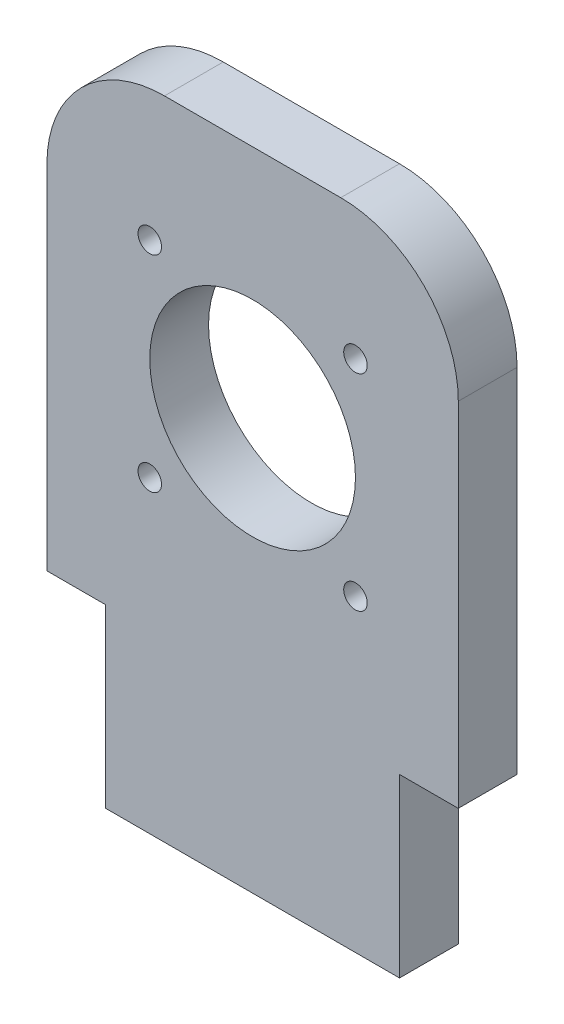
ISO-10303-21;
HEADER;
FILE_DESCRIPTION(('STEP AP214'),'2;1');
FILE_NAME('part.step','',(''),(''),'','','');
FILE_SCHEMA(('AUTOMOTIVE_DESIGN { 1 0 10303 214 1 1 1 1 }'));
ENDSEC;
DATA;
#1=APPLICATION_CONTEXT('core data for automotive mechanical design processes');
#2=APPLICATION_PROTOCOL_DEFINITION('international standard','automotive_design',2000,#1);
#3=PRODUCT_CONTEXT('',#1,'mechanical');
#4=PRODUCT('Part','Part','',(#3));
#5=PRODUCT_RELATED_PRODUCT_CATEGORY('part','',(#4));
#6=PRODUCT_DEFINITION_FORMATION('','',#4);
#7=PRODUCT_DEFINITION_CONTEXT('part definition',#1,'design');
#8=PRODUCT_DEFINITION('design','',#6,#7);
#9=PRODUCT_DEFINITION_SHAPE('','',#8);
#10=(LENGTH_UNIT() NAMED_UNIT(*) SI_UNIT(.MILLI.,.METRE.));
#11=(NAMED_UNIT(*) PLANE_ANGLE_UNIT() SI_UNIT($,.RADIAN.));
#12=(NAMED_UNIT(*) SI_UNIT($,.STERADIAN.) SOLID_ANGLE_UNIT());
#13=UNCERTAINTY_MEASURE_WITH_UNIT(LENGTH_MEASURE(1.E-05),#10,'distance_accuracy_value','');
#14=(GEOMETRIC_REPRESENTATION_CONTEXT(3) GLOBAL_UNCERTAINTY_ASSIGNED_CONTEXT((#13)) GLOBAL_UNIT_ASSIGNED_CONTEXT((#10,
#11,#12)) REPRESENTATION_CONTEXT('',''));
#15=CARTESIAN_POINT('',(0.,0.,0.));
#16=DIRECTION('',(0.,0.,1.));
#17=DIRECTION('',(1.,0.,0.));
#18=AXIS2_PLACEMENT_3D('',#15,#16,#17);
#19=CARTESIAN_POINT('',(10.,0.,10.));
#20=DIRECTION('',(1.,0.,0.));
#21=DIRECTION('',(0.,1.,0.));
#22=AXIS2_PLACEMENT_3D('',#19,#20,#21);
#23=PLANE('',#22);
#24=DIRECTION('',(0.,-1.,0.));
#25=VECTOR('',#24,1.);
#26=CARTESIAN_POINT('',(10.,0.,0.));
#27=LINE('',#26,#25);
#28=CARTESIAN_POINT('',(10.,-80.,0.));
#29=VERTEX_POINT('',#28);
#30=CARTESIAN_POINT('',(10.,-110.,0.));
#31=VERTEX_POINT('',#30);
#32=EDGE_CURVE('E176',#29,#31,#27,.T.);
#33=ORIENTED_EDGE('',*,*,#32,.T.);
#34=DIRECTION('',(0.,0.,-1.));
#35=VECTOR('',#34,1.);
#36=CARTESIAN_POINT('',(10.,-110.,10.));
#37=LINE('',#36,#35);
#38=CARTESIAN_POINT('',(10.,-110.,10.));
#39=VERTEX_POINT('',#38);
#40=EDGE_CURVE('E158',#39,#31,#37,.T.);
#41=ORIENTED_EDGE('',*,*,#40,.F.);
#42=DIRECTION('',(0.,-1.,0.));
#43=VECTOR('',#42,1.);
#44=CARTESIAN_POINT('',(10.,0.,10.));
#45=LINE('',#44,#43);
#46=CARTESIAN_POINT('',(10.,-80.,10.));
#47=VERTEX_POINT('',#46);
#48=EDGE_CURVE('E164',#47,#39,#45,.T.);
#49=ORIENTED_EDGE('',*,*,#48,.F.);
#50=DIRECTION('',(0.,0.,-1.));
#51=VECTOR('',#50,1.);
#52=CARTESIAN_POINT('',(10.,-80.,10.));
#53=LINE('',#52,#51);
#54=EDGE_CURVE('E253',#47,#29,#53,.T.);
#55=ORIENTED_EDGE('',*,*,#54,.T.);
#56=EDGE_LOOP('',(#33,#41,#49,#55));
#57=FACE_BOUND('',#56,.T.);
#58=ADVANCED_FACE('F74',(#57),#23,.F.);
#59=CARTESIAN_POINT('',(0.,-110.,10.));
#60=DIRECTION('',(0.,1.,0.));
#61=DIRECTION('',(-1.,0.,0.));
#62=AXIS2_PLACEMENT_3D('',#59,#60,#61);
#63=PLANE('',#62);
#64=DIRECTION('',(1.,0.,0.));
#65=VECTOR('',#64,1.);
#66=CARTESIAN_POINT('',(0.,-110.,0.));
#67=LINE('',#66,#65);
#68=CARTESIAN_POINT('',(60.,-110.,0.));
#69=VERTEX_POINT('',#68);
#70=EDGE_CURVE('E248',#31,#69,#67,.T.);
#71=ORIENTED_EDGE('',*,*,#70,.T.);
#72=DIRECTION('',(0.,0.,-1.));
#73=VECTOR('',#72,1.);
#74=CARTESIAN_POINT('',(60.,-110.,10.));
#75=LINE('',#74,#73);
#76=CARTESIAN_POINT('',(60.,-110.,10.));
#77=VERTEX_POINT('',#76);
#78=EDGE_CURVE('E160',#77,#69,#75,.T.);
#79=ORIENTED_EDGE('',*,*,#78,.F.);
#80=DIRECTION('',(1.,0.,0.));
#81=VECTOR('',#80,1.);
#82=CARTESIAN_POINT('',(0.,-110.,10.));
#83=LINE('',#82,#81);
#84=EDGE_CURVE('E153',#39,#77,#83,.T.);
#85=ORIENTED_EDGE('',*,*,#84,.F.);
#86=ORIENTED_EDGE('',*,*,#40,.T.);
#87=EDGE_LOOP('',(#71,#79,#85,#86));
#88=FACE_BOUND('',#87,.T.);
#89=ADVANCED_FACE('F156',(#88),#63,.F.);
#90=CARTESIAN_POINT('',(60.,0.,10.));
#91=DIRECTION('',(1.,0.,0.));
#92=DIRECTION('',(0.,1.,0.));
#93=AXIS2_PLACEMENT_3D('',#90,#91,#92);
#94=PLANE('',#93);
#95=DIRECTION('',(0.,-1.,0.));
#96=VECTOR('',#95,1.);
#97=CARTESIAN_POINT('',(60.,0.,0.));
#98=LINE('',#97,#96);
#99=CARTESIAN_POINT('',(60.,-80.,0.));
#100=VERTEX_POINT('',#99);
#101=EDGE_CURVE('E173',#100,#69,#98,.T.);
#102=ORIENTED_EDGE('',*,*,#101,.F.);
#103=DIRECTION('',(0.,0.,-1.));
#104=VECTOR('',#103,1.);
#105=CARTESIAN_POINT('',(60.,-80.,10.));
#106=LINE('',#105,#104);
#107=CARTESIAN_POINT('',(60.,-80.,10.));
#108=VERTEX_POINT('',#107);
#109=EDGE_CURVE('E181',#108,#100,#106,.T.);
#110=ORIENTED_EDGE('',*,*,#109,.F.);
#111=DIRECTION('',(0.,-1.,0.));
#112=VECTOR('',#111,1.);
#113=CARTESIAN_POINT('',(60.,0.,10.));
#114=LINE('',#113,#112);
#115=EDGE_CURVE('E163',#108,#77,#114,.T.);
#116=ORIENTED_EDGE('',*,*,#115,.T.);
#117=ORIENTED_EDGE('',*,*,#78,.T.);
#118=EDGE_LOOP('',(#102,#110,#116,#117));
#119=FACE_BOUND('',#118,.T.);
#120=ADVANCED_FACE('F247',(#119),#94,.T.);
#121=CARTESIAN_POINT('',(0.,0.,10.));
#122=DIRECTION('',(0.,0.,1.));
#123=DIRECTION('',(1.,0.,0.));
#124=AXIS2_PLACEMENT_3D('',#121,#122,#123);
#125=PLANE('',#124);
#126=CARTESIAN_POINT('',(17.5,-57.5,10.));
#127=DIRECTION('',(0.,0.,1.));
#128=DIRECTION('',(1.,0.,0.));
#129=AXIS2_PLACEMENT_3D('',#126,#127,#128);
#130=CIRCLE('',#129,2.);
#131=CARTESIAN_POINT('',(19.5,-57.5,10.));
#132=VERTEX_POINT('',#131);
#133=EDGE_CURVE('E262',#132,#132,#130,.T.);
#134=ORIENTED_EDGE('',*,*,#133,.F.);
#135=EDGE_LOOP('',(#134));
#136=FACE_BOUND('',#135,.T.);
#137=CARTESIAN_POINT('',(52.5,-57.5,10.));
#138=DIRECTION('',(0.,0.,1.));
#139=DIRECTION('',(1.,0.,0.));
#140=AXIS2_PLACEMENT_3D('',#137,#138,#139);
#141=CIRCLE('',#140,2.);
#142=CARTESIAN_POINT('',(54.5,-57.5,10.));
#143=VERTEX_POINT('',#142);
#144=EDGE_CURVE('E268',#143,#143,#141,.T.);
#145=ORIENTED_EDGE('',*,*,#144,.F.);
#146=EDGE_LOOP('',(#145));
#147=FACE_BOUND('',#146,.T.);
#148=CARTESIAN_POINT('',(52.5,-22.5,10.));
#149=DIRECTION('',(0.,0.,1.));
#150=DIRECTION('',(1.,0.,0.));
#151=AXIS2_PLACEMENT_3D('',#148,#149,#150);
#152=CIRCLE('',#151,2.);
#153=CARTESIAN_POINT('',(54.5,-22.5,10.));
#154=VERTEX_POINT('',#153);
#155=EDGE_CURVE('E274',#154,#154,#152,.T.);
#156=ORIENTED_EDGE('',*,*,#155,.F.);
#157=EDGE_LOOP('',(#156));
#158=FACE_BOUND('',#157,.T.);
#159=CARTESIAN_POINT('',(17.5,-22.5,10.));
#160=DIRECTION('',(0.,0.,1.));
#161=DIRECTION('',(1.,0.,0.));
#162=AXIS2_PLACEMENT_3D('',#159,#160,#161);
#163=CIRCLE('',#162,2.);
#164=CARTESIAN_POINT('',(19.5,-22.5,10.));
#165=VERTEX_POINT('',#164);
#166=EDGE_CURVE('E256',#165,#165,#163,.T.);
#167=ORIENTED_EDGE('',*,*,#166,.F.);
#168=EDGE_LOOP('',(#167));
#169=FACE_BOUND('',#168,.T.);
#170=DIRECTION('',(0.,-1.,0.));
#171=VECTOR('',#170,1.);
#172=CARTESIAN_POINT('',(70.,0.,10.));
#173=LINE('',#172,#171);
#174=CARTESIAN_POINT('',(70.,-20.,10.));
#175=VERTEX_POINT('',#174);
#176=CARTESIAN_POINT('',(70.,-80.,10.));
#177=VERTEX_POINT('',#176);
#178=EDGE_CURVE('E198',#175,#177,#173,.T.);
#179=ORIENTED_EDGE('',*,*,#178,.F.);
#180=CARTESIAN_POINT('',(50.,-20.,10.));
#181=DIRECTION('',(0.,0.,1.));
#182=DIRECTION('',(1.,0.,0.));
#183=AXIS2_PLACEMENT_3D('',#180,#181,#182);
#184=CIRCLE('',#183,20.);
#185=CARTESIAN_POINT('',(50.,0.,10.));
#186=VERTEX_POINT('',#185);
#187=EDGE_CURVE('E82',#175,#186,#184,.T.);
#188=ORIENTED_EDGE('',*,*,#187,.T.);
#189=DIRECTION('',(1.,0.,0.));
#190=VECTOR('',#189,1.);
#191=CARTESIAN_POINT('',(0.,0.,10.));
#192=LINE('',#191,#190);
#193=CARTESIAN_POINT('',(20.,0.,10.));
#194=VERTEX_POINT('',#193);
#195=EDGE_CURVE('E200',#194,#186,#192,.T.);
#196=ORIENTED_EDGE('',*,*,#195,.F.);
#197=CARTESIAN_POINT('',(20.,-20.,10.));
#198=DIRECTION('',(0.,0.,1.));
#199=DIRECTION('',(1.,0.,0.));
#200=AXIS2_PLACEMENT_3D('',#197,#198,#199);
#201=CIRCLE('',#200,20.);
#202=CARTESIAN_POINT('',(0.,-20.,10.));
#203=VERTEX_POINT('',#202);
#204=EDGE_CURVE('E89',#194,#203,#201,.T.);
#205=ORIENTED_EDGE('',*,*,#204,.T.);
#206=DIRECTION('',(0.,-1.,0.));
#207=VECTOR('',#206,1.);
#208=CARTESIAN_POINT('',(0.,0.,10.));
#209=LINE('',#208,#207);
#210=CARTESIAN_POINT('',(0.,-80.,10.));
#211=VERTEX_POINT('',#210);
#212=EDGE_CURVE('E193',#203,#211,#209,.T.);
#213=ORIENTED_EDGE('',*,*,#212,.T.);
#214=DIRECTION('',(1.,0.,0.));
#215=VECTOR('',#214,1.);
#216=CARTESIAN_POINT('',(0.,-80.,10.));
#217=LINE('',#216,#215);
#218=EDGE_CURVE('E171',#211,#47,#217,.T.);
#219=ORIENTED_EDGE('',*,*,#218,.T.);
#220=ORIENTED_EDGE('',*,*,#48,.T.);
#221=ORIENTED_EDGE('',*,*,#84,.T.);
#222=ORIENTED_EDGE('',*,*,#115,.F.);
#223=EDGE_CURVE('E195',#108,#177,#217,.T.);
#224=ORIENTED_EDGE('',*,*,#223,.T.);
#225=EDGE_LOOP('',(#179,#188,#196,#205,#213,#219,#220,#221,#222,#224));
#226=FACE_BOUND('',#225,.T.);
#227=CARTESIAN_POINT('',(35.,-40.,10.));
#228=DIRECTION('',(0.,0.,1.));
#229=DIRECTION('',(1.,0.,0.));
#230=AXIS2_PLACEMENT_3D('',#227,#228,#229);
#231=CIRCLE('',#230,17.5);
#232=CARTESIAN_POINT('',(52.5,-40.,10.));
#233=VERTEX_POINT('',#232);
#234=EDGE_CURVE('E185',#233,#233,#231,.T.);
#235=ORIENTED_EDGE('',*,*,#234,.F.);
#236=EDGE_LOOP('',(#235));
#237=FACE_BOUND('',#236,.T.);
#238=ADVANCED_FACE('F168',(#136,#147,#158,#169,#226,#237),#125,.T.);
#239=CARTESIAN_POINT('',(0.,0.,0.));
#240=DIRECTION('',(0.,0.,1.));
#241=DIRECTION('',(1.,0.,0.));
#242=AXIS2_PLACEMENT_3D('',#239,#240,#241);
#243=PLANE('',#242);
#244=CARTESIAN_POINT('',(17.5,-57.5,0.));
#245=DIRECTION('',(0.,0.,1.));
#246=DIRECTION('',(1.,0.,0.));
#247=AXIS2_PLACEMENT_3D('',#244,#245,#246);
#248=CIRCLE('',#247,2.);
#249=CARTESIAN_POINT('',(19.5,-57.5,0.));
#250=VERTEX_POINT('',#249);
#251=EDGE_CURVE('E265',#250,#250,#248,.T.);
#252=ORIENTED_EDGE('',*,*,#251,.T.);
#253=EDGE_LOOP('',(#252));
#254=FACE_BOUND('',#253,.T.);
#255=CARTESIAN_POINT('',(52.5,-57.5,0.));
#256=DIRECTION('',(0.,0.,1.));
#257=DIRECTION('',(1.,0.,0.));
#258=AXIS2_PLACEMENT_3D('',#255,#256,#257);
#259=CIRCLE('',#258,2.);
#260=CARTESIAN_POINT('',(54.5,-57.5,0.));
#261=VERTEX_POINT('',#260);
#262=EDGE_CURVE('E271',#261,#261,#259,.T.);
#263=ORIENTED_EDGE('',*,*,#262,.T.);
#264=EDGE_LOOP('',(#263));
#265=FACE_BOUND('',#264,.T.);
#266=CARTESIAN_POINT('',(52.5,-22.5,0.));
#267=DIRECTION('',(0.,0.,1.));
#268=DIRECTION('',(1.,0.,0.));
#269=AXIS2_PLACEMENT_3D('',#266,#267,#268);
#270=CIRCLE('',#269,2.);
#271=CARTESIAN_POINT('',(54.5,-22.5,0.));
#272=VERTEX_POINT('',#271);
#273=EDGE_CURVE('E259',#272,#272,#270,.T.);
#274=ORIENTED_EDGE('',*,*,#273,.T.);
#275=EDGE_LOOP('',(#274));
#276=FACE_BOUND('',#275,.T.);
#277=CARTESIAN_POINT('',(17.5,-22.5,0.));
#278=DIRECTION('',(0.,0.,1.));
#279=DIRECTION('',(1.,0.,0.));
#280=AXIS2_PLACEMENT_3D('',#277,#278,#279);
#281=CIRCLE('',#280,2.);
#282=CARTESIAN_POINT('',(19.5,-22.5,0.));
#283=VERTEX_POINT('',#282);
#284=EDGE_CURVE('E192',#283,#283,#281,.T.);
#285=ORIENTED_EDGE('',*,*,#284,.T.);
#286=EDGE_LOOP('',(#285));
#287=FACE_BOUND('',#286,.T.);
#288=DIRECTION('',(1.,0.,0.));
#289=VECTOR('',#288,1.);
#290=CARTESIAN_POINT('',(0.,0.,0.));
#291=LINE('',#290,#289);
#292=CARTESIAN_POINT('',(20.,0.,0.));
#293=VERTEX_POINT('',#292);
#294=CARTESIAN_POINT('',(50.,0.,0.));
#295=VERTEX_POINT('',#294);
#296=EDGE_CURVE('E196',#293,#295,#291,.T.);
#297=ORIENTED_EDGE('',*,*,#296,.T.);
#298=CARTESIAN_POINT('',(50.,-20.,0.));
#299=DIRECTION('',(0.,0.,1.));
#300=DIRECTION('',(1.,0.,0.));
#301=AXIS2_PLACEMENT_3D('',#298,#299,#300);
#302=CIRCLE('',#301,20.);
#303=CARTESIAN_POINT('',(70.,-20.,0.));
#304=VERTEX_POINT('',#303);
#305=EDGE_CURVE('E222',#295,#304,#302,.F.);
#306=ORIENTED_EDGE('',*,*,#305,.T.);
#307=DIRECTION('',(0.,-1.,0.));
#308=VECTOR('',#307,1.);
#309=CARTESIAN_POINT('',(70.,0.,0.));
#310=LINE('',#309,#308);
#311=CARTESIAN_POINT('',(70.,-80.,0.));
#312=VERTEX_POINT('',#311);
#313=EDGE_CURVE('E209',#304,#312,#310,.T.);
#314=ORIENTED_EDGE('',*,*,#313,.T.);
#315=DIRECTION('',(1.,0.,0.));
#316=VECTOR('',#315,1.);
#317=CARTESIAN_POINT('',(0.,-80.,0.));
#318=LINE('',#317,#316);
#319=EDGE_CURVE('E205',#100,#312,#318,.T.);
#320=ORIENTED_EDGE('',*,*,#319,.F.);
#321=ORIENTED_EDGE('',*,*,#101,.T.);
#322=ORIENTED_EDGE('',*,*,#70,.F.);
#323=ORIENTED_EDGE('',*,*,#32,.F.);
#324=CARTESIAN_POINT('',(0.,-80.,0.));
#325=VERTEX_POINT('',#324);
#326=EDGE_CURVE('E206',#325,#29,#318,.T.);
#327=ORIENTED_EDGE('',*,*,#326,.F.);
#328=DIRECTION('',(0.,-1.,0.));
#329=VECTOR('',#328,1.);
#330=CARTESIAN_POINT('',(0.,0.,0.));
#331=LINE('',#330,#329);
#332=CARTESIAN_POINT('',(0.,-20.,0.));
#333=VERTEX_POINT('',#332);
#334=EDGE_CURVE('E188',#333,#325,#331,.T.);
#335=ORIENTED_EDGE('',*,*,#334,.F.);
#336=CARTESIAN_POINT('',(20.,-20.,0.));
#337=DIRECTION('',(0.,0.,1.));
#338=DIRECTION('',(1.,0.,0.));
#339=AXIS2_PLACEMENT_3D('',#336,#337,#338);
#340=CIRCLE('',#339,20.);
#341=EDGE_CURVE('E220',#333,#293,#340,.F.);
#342=ORIENTED_EDGE('',*,*,#341,.T.);
#343=EDGE_LOOP('',(#297,#306,#314,#320,#321,#322,#323,#327,#335,#342));
#344=FACE_BOUND('',#343,.T.);
#345=CARTESIAN_POINT('',(35.,-40.,0.));
#346=DIRECTION('',(0.,0.,1.));
#347=DIRECTION('',(1.,0.,0.));
#348=AXIS2_PLACEMENT_3D('',#345,#346,#347);
#349=CIRCLE('',#348,17.5);
#350=CARTESIAN_POINT('',(52.5,-40.,0.));
#351=VERTEX_POINT('',#350);
#352=EDGE_CURVE('E189',#351,#351,#349,.T.);
#353=ORIENTED_EDGE('',*,*,#352,.T.);
#354=EDGE_LOOP('',(#353));
#355=FACE_BOUND('',#354,.T.);
#356=ADVANCED_FACE('F235',(#254,#265,#276,#287,#344,#355),#243,.F.);
#357=CARTESIAN_POINT('',(35.,-40.,10.));
#358=DIRECTION('',(0.,0.,-1.));
#359=DIRECTION('',(-1.,0.,0.));
#360=AXIS2_PLACEMENT_3D('',#357,#358,#359);
#361=CYLINDRICAL_SURFACE('',#360,17.5);
#362=ORIENTED_EDGE('',*,*,#234,.T.);
#363=EDGE_LOOP('',(#362));
#364=FACE_BOUND('',#363,.T.);
#365=ORIENTED_EDGE('',*,*,#352,.F.);
#366=EDGE_LOOP('',(#365));
#367=FACE_BOUND('',#366,.T.);
#368=ADVANCED_FACE('F321',(#364,#367),#361,.F.);
#369=CARTESIAN_POINT('',(0.,0.,10.));
#370=DIRECTION('',(0.,1.,0.));
#371=DIRECTION('',(0.,0.,1.));
#372=AXIS2_PLACEMENT_3D('',#369,#370,#371);
#373=PLANE('',#372);
#374=ORIENTED_EDGE('',*,*,#195,.T.);
#375=DIRECTION('',(0.,0.,-1.));
#376=VECTOR('',#375,1.);
#377=CARTESIAN_POINT('',(50.,0.,10.));
#378=LINE('',#377,#376);
#379=EDGE_CURVE('E179',#186,#295,#378,.T.);
#380=ORIENTED_EDGE('',*,*,#379,.T.);
#381=ORIENTED_EDGE('',*,*,#296,.F.);
#382=DIRECTION('',(0.,0.,-1.));
#383=VECTOR('',#382,1.);
#384=CARTESIAN_POINT('',(20.,0.,10.));
#385=LINE('',#384,#383);
#386=EDGE_CURVE('E177',#293,#194,#385,.F.);
#387=ORIENTED_EDGE('',*,*,#386,.T.);
#388=EDGE_LOOP('',(#374,#380,#381,#387));
#389=FACE_BOUND('',#388,.T.);
#390=ADVANCED_FACE('F230',(#389),#373,.T.);
#391=CARTESIAN_POINT('',(0.,0.,10.));
#392=DIRECTION('',(1.,0.,0.));
#393=DIRECTION('',(0.,1.,0.));
#394=AXIS2_PLACEMENT_3D('',#391,#392,#393);
#395=PLANE('',#394);
#396=ORIENTED_EDGE('',*,*,#212,.F.);
#397=DIRECTION('',(0.,0.,-1.));
#398=VECTOR('',#397,1.);
#399=CARTESIAN_POINT('',(0.,-20.,0.));
#400=LINE('',#399,#398);
#401=EDGE_CURVE('E12',#203,#333,#400,.T.);
#402=ORIENTED_EDGE('',*,*,#401,.T.);
#403=ORIENTED_EDGE('',*,*,#334,.T.);
#404=DIRECTION('',(0.,0.,-1.));
#405=VECTOR('',#404,1.);
#406=CARTESIAN_POINT('',(0.,-80.,10.));
#407=LINE('',#406,#405);
#408=EDGE_CURVE('E215',#211,#325,#407,.T.);
#409=ORIENTED_EDGE('',*,*,#408,.F.);
#410=EDGE_LOOP('',(#396,#402,#403,#409));
#411=FACE_BOUND('',#410,.T.);
#412=ADVANCED_FACE('F308',(#411),#395,.F.);
#413=CARTESIAN_POINT('',(70.,0.,10.));
#414=DIRECTION('',(1.,0.,0.));
#415=DIRECTION('',(0.,1.,0.));
#416=AXIS2_PLACEMENT_3D('',#413,#414,#415);
#417=PLANE('',#416);
#418=ORIENTED_EDGE('',*,*,#313,.F.);
#419=DIRECTION('',(0.,0.,-1.));
#420=VECTOR('',#419,1.);
#421=CARTESIAN_POINT('',(70.,-20.,10.));
#422=LINE('',#421,#420);
#423=EDGE_CURVE('E97',#304,#175,#422,.F.);
#424=ORIENTED_EDGE('',*,*,#423,.T.);
#425=ORIENTED_EDGE('',*,*,#178,.T.);
#426=DIRECTION('',(0.,0.,-1.));
#427=VECTOR('',#426,1.);
#428=CARTESIAN_POINT('',(70.,-80.,10.));
#429=LINE('',#428,#427);
#430=EDGE_CURVE('E203',#177,#312,#429,.T.);
#431=ORIENTED_EDGE('',*,*,#430,.T.);
#432=EDGE_LOOP('',(#418,#424,#425,#431));
#433=FACE_BOUND('',#432,.T.);
#434=ADVANCED_FACE('F239',(#433),#417,.T.);
#435=CARTESIAN_POINT('',(0.,-80.,10.));
#436=DIRECTION('',(0.,1.,0.));
#437=DIRECTION('',(-1.,0.,0.));
#438=AXIS2_PLACEMENT_3D('',#435,#436,#437);
#439=PLANE('',#438);
#440=ORIENTED_EDGE('',*,*,#223,.F.);
#441=ORIENTED_EDGE('',*,*,#109,.T.);
#442=ORIENTED_EDGE('',*,*,#319,.T.);
#443=ORIENTED_EDGE('',*,*,#430,.F.);
#444=EDGE_LOOP('',(#440,#441,#442,#443));
#445=FACE_BOUND('',#444,.T.);
#446=ADVANCED_FACE('F243',(#445),#439,.F.);
#447=ORIENTED_EDGE('',*,*,#54,.F.);
#448=ORIENTED_EDGE('',*,*,#218,.F.);
#449=ORIENTED_EDGE('',*,*,#408,.T.);
#450=ORIENTED_EDGE('',*,*,#326,.T.);
#451=EDGE_LOOP('',(#447,#448,#449,#450));
#452=FACE_BOUND('',#451,.T.);
#453=ADVANCED_FACE('F306',(#452),#439,.F.);
#454=CARTESIAN_POINT('',(50.,-20.,10.));
#455=DIRECTION('',(0.,0.,-1.));
#456=DIRECTION('',(-1.,0.,0.));
#457=AXIS2_PLACEMENT_3D('',#454,#455,#456);
#458=CYLINDRICAL_SURFACE('',#457,20.);
#459=ORIENTED_EDGE('',*,*,#187,.F.);
#460=ORIENTED_EDGE('',*,*,#423,.F.);
#461=ORIENTED_EDGE('',*,*,#305,.F.);
#462=ORIENTED_EDGE('',*,*,#379,.F.);
#463=EDGE_LOOP('',(#459,#460,#461,#462));
#464=FACE_BOUND('',#463,.T.);
#465=ADVANCED_FACE('F233',(#464),#458,.T.);
#466=CARTESIAN_POINT('',(20.,-20.,10.));
#467=DIRECTION('',(0.,0.,1.));
#468=DIRECTION('',(1.,0.,0.));
#469=AXIS2_PLACEMENT_3D('',#466,#467,#468);
#470=CYLINDRICAL_SURFACE('',#469,20.);
#471=ORIENTED_EDGE('',*,*,#204,.F.);
#472=ORIENTED_EDGE('',*,*,#386,.F.);
#473=ORIENTED_EDGE('',*,*,#341,.F.);
#474=ORIENTED_EDGE('',*,*,#401,.F.);
#475=EDGE_LOOP('',(#471,#472,#473,#474));
#476=FACE_BOUND('',#475,.T.);
#477=ADVANCED_FACE('F76',(#476),#470,.T.);
#478=CARTESIAN_POINT('',(17.5,-22.5,0.));
#479=DIRECTION('',(0.,0.,1.));
#480=DIRECTION('',(1.,0.,0.));
#481=AXIS2_PLACEMENT_3D('',#478,#479,#480);
#482=CYLINDRICAL_SURFACE('',#481,2.);
#483=ORIENTED_EDGE('',*,*,#284,.F.);
#484=EDGE_LOOP('',(#483));
#485=FACE_BOUND('',#484,.T.);
#486=ORIENTED_EDGE('',*,*,#166,.T.);
#487=EDGE_LOOP('',(#486));
#488=FACE_BOUND('',#487,.T.);
#489=ADVANCED_FACE('F286',(#485,#488),#482,.F.);
#490=CARTESIAN_POINT('',(52.5,-22.5,0.));
#491=DIRECTION('',(0.,0.,1.));
#492=DIRECTION('',(1.,0.,0.));
#493=AXIS2_PLACEMENT_3D('',#490,#491,#492);
#494=CYLINDRICAL_SURFACE('',#493,2.);
#495=ORIENTED_EDGE('',*,*,#273,.F.);
#496=EDGE_LOOP('',(#495));
#497=FACE_BOUND('',#496,.T.);
#498=ORIENTED_EDGE('',*,*,#155,.T.);
#499=EDGE_LOOP('',(#498));
#500=FACE_BOUND('',#499,.T.);
#501=ADVANCED_FACE('F282',(#497,#500),#494,.F.);
#502=CARTESIAN_POINT('',(52.5,-57.5,0.));
#503=DIRECTION('',(0.,0.,1.));
#504=DIRECTION('',(1.,0.,0.));
#505=AXIS2_PLACEMENT_3D('',#502,#503,#504);
#506=CYLINDRICAL_SURFACE('',#505,2.);
#507=ORIENTED_EDGE('',*,*,#262,.F.);
#508=EDGE_LOOP('',(#507));
#509=FACE_BOUND('',#508,.T.);
#510=ORIENTED_EDGE('',*,*,#144,.T.);
#511=EDGE_LOOP('',(#510));
#512=FACE_BOUND('',#511,.T.);
#513=ADVANCED_FACE('F285',(#509,#512),#506,.F.);
#514=CARTESIAN_POINT('',(17.5,-57.5,0.));
#515=DIRECTION('',(0.,0.,1.));
#516=DIRECTION('',(1.,0.,0.));
#517=AXIS2_PLACEMENT_3D('',#514,#515,#516);
#518=CYLINDRICAL_SURFACE('',#517,2.);
#519=ORIENTED_EDGE('',*,*,#251,.F.);
#520=EDGE_LOOP('',(#519));
#521=FACE_BOUND('',#520,.T.);
#522=ORIENTED_EDGE('',*,*,#133,.T.);
#523=EDGE_LOOP('',(#522));
#524=FACE_BOUND('',#523,.T.);
#525=ADVANCED_FACE('F383',(#521,#524),#518,.F.);
#526=CLOSED_SHELL('',(#58,#89,#120,#238,#356,#368,#390,#412,#434,#446,#453,#465,#477,#489,#501,
#513,#525));
#527=MANIFOLD_SOLID_BREP('B2',#526);
#528=ADVANCED_BREP_SHAPE_REPRESENTATION('',(#18,#527),#14);
#529=SHAPE_DEFINITION_REPRESENTATION(#9,#528);
ENDSEC;
END-ISO-10303-21;
